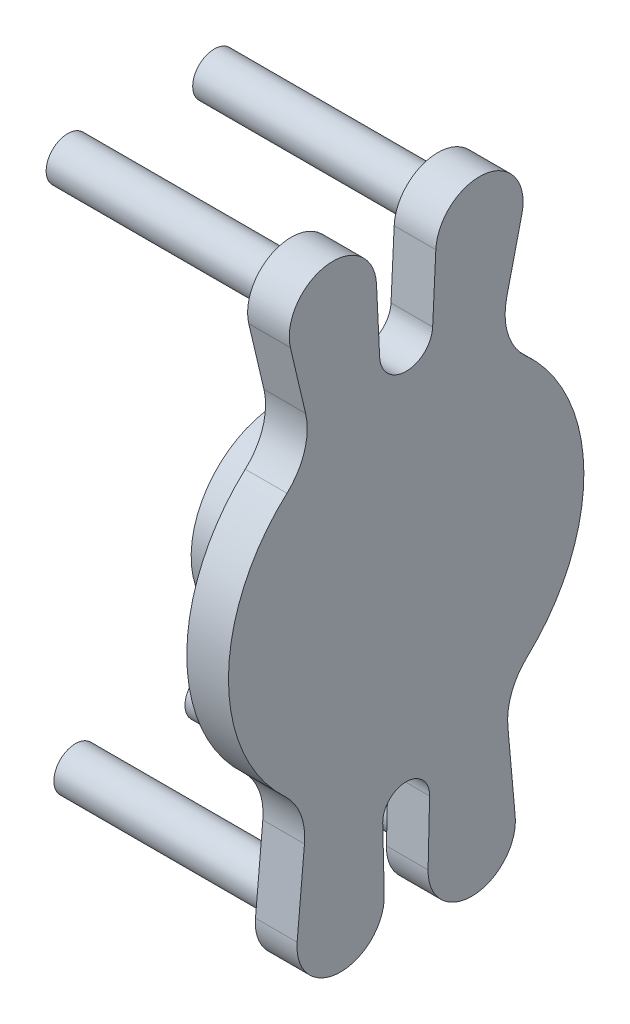
ISO-10303-21;
HEADER;
FILE_DESCRIPTION(('STEP AP214'),'2;1');
FILE_NAME('part.step','',(''),(''),'','','');
FILE_SCHEMA(('AUTOMOTIVE_DESIGN { 1 0 10303 214 1 1 1 1 }'));
ENDSEC;
DATA;
#1=APPLICATION_CONTEXT('core data for automotive mechanical design processes');
#2=APPLICATION_PROTOCOL_DEFINITION('international standard','automotive_design',2000,#1);
#3=PRODUCT_CONTEXT('',#1,'mechanical');
#4=PRODUCT('Part','Part','',(#3));
#5=PRODUCT_RELATED_PRODUCT_CATEGORY('part','',(#4));
#6=PRODUCT_DEFINITION_FORMATION('','',#4);
#7=PRODUCT_DEFINITION_CONTEXT('part definition',#1,'design');
#8=PRODUCT_DEFINITION('design','',#6,#7);
#9=PRODUCT_DEFINITION_SHAPE('','',#8);
#10=(LENGTH_UNIT() NAMED_UNIT(*) SI_UNIT(.MILLI.,.METRE.));
#11=(NAMED_UNIT(*) PLANE_ANGLE_UNIT() SI_UNIT($,.RADIAN.));
#12=(NAMED_UNIT(*) SI_UNIT($,.STERADIAN.) SOLID_ANGLE_UNIT());
#13=UNCERTAINTY_MEASURE_WITH_UNIT(LENGTH_MEASURE(1.E-05),#10,'distance_accuracy_value','');
#14=(GEOMETRIC_REPRESENTATION_CONTEXT(3) GLOBAL_UNCERTAINTY_ASSIGNED_CONTEXT((#13)) GLOBAL_UNIT_ASSIGNED_CONTEXT((#10,
#11,#12)) REPRESENTATION_CONTEXT('',''));
#15=CARTESIAN_POINT('',(0.,0.,0.));
#16=DIRECTION('',(0.,0.,1.));
#17=DIRECTION('',(1.,0.,0.));
#18=AXIS2_PLACEMENT_3D('',#15,#16,#17);
#19=CARTESIAN_POINT('',(8.25500000000001,0.,0.));
#20=DIRECTION('',(1.,0.,0.));
#21=DIRECTION('',(0.,1.,0.));
#22=AXIS2_PLACEMENT_3D('',#19,#20,#21);
#23=PLANE('',#22);
#24=CARTESIAN_POINT('',(8.25500000000001,0.,0.));
#25=DIRECTION('',(-1.,0.,0.));
#26=DIRECTION('',(0.,-1.,0.));
#27=AXIS2_PLACEMENT_3D('',#24,#25,#26);
#28=CIRCLE('',#27,3.71475);
#29=CARTESIAN_POINT('',(8.25500000000001,-3.71474999999999,0.));
#30=VERTEX_POINT('',#29);
#31=EDGE_CURVE('E297',#30,#30,#28,.T.);
#32=ORIENTED_EDGE('',*,*,#31,.F.);
#33=EDGE_LOOP('',(#32));
#34=FACE_BOUND('',#33,.T.);
#35=CARTESIAN_POINT('',(8.25500000000001,0.,0.));
#36=DIRECTION('',(-1.,0.,0.));
#37=DIRECTION('',(0.,-1.,0.));
#38=AXIS2_PLACEMENT_3D('',#35,#36,#37);
#39=CIRCLE('',#38,18.542);
#40=CARTESIAN_POINT('',(8.25500000000002,-18.542,0.));
#41=VERTEX_POINT('',#40);
#42=EDGE_CURVE('E296',#41,#41,#39,.T.);
#43=ORIENTED_EDGE('',*,*,#42,.T.);
#44=EDGE_LOOP('',(#43));
#45=FACE_BOUND('',#44,.T.);
#46=ADVANCED_FACE('F33',(#34,#45),#23,.F.);
#47=CARTESIAN_POINT('',(8.255,0.,0.));
#48=DIRECTION('',(-1.,0.,0.));
#49=DIRECTION('',(0.,-1.,0.));
#50=AXIS2_PLACEMENT_3D('',#47,#48,#49);
#51=CYLINDRICAL_SURFACE('',#50,18.542);
#52=ORIENTED_EDGE('',*,*,#42,.F.);
#53=EDGE_LOOP('',(#52));
#54=FACE_BOUND('',#53,.T.);
#55=CARTESIAN_POINT('',(25.4,0.,0.));
#56=DIRECTION('',(-1.,0.,0.));
#57=DIRECTION('',(0.,-1.,0.));
#58=AXIS2_PLACEMENT_3D('',#55,#56,#57);
#59=CIRCLE('',#58,18.542);
#60=CARTESIAN_POINT('',(25.4,-18.542,0.));
#61=VERTEX_POINT('',#60);
#62=EDGE_CURVE('E292',#61,#61,#59,.T.);
#63=ORIENTED_EDGE('',*,*,#62,.T.);
#64=EDGE_LOOP('',(#63));
#65=FACE_BOUND('',#64,.T.);
#66=ADVANCED_FACE('F342',(#54,#65),#51,.T.);
#67=CARTESIAN_POINT('',(16.8275,0.,0.));
#68=DIRECTION('',(-1.,0.,0.));
#69=DIRECTION('',(0.,-1.,0.));
#70=AXIS2_PLACEMENT_3D('',#67,#68,#69);
#71=CYLINDRICAL_SURFACE('',#70,3.71475);
#72=CARTESIAN_POINT('',(16.8275,0.,0.));
#73=DIRECTION('',(-1.,0.,0.));
#74=DIRECTION('',(0.,-1.,0.));
#75=AXIS2_PLACEMENT_3D('',#72,#73,#74);
#76=CIRCLE('',#75,3.71475);
#77=CARTESIAN_POINT('',(16.8275,-3.71474999999999,0.));
#78=VERTEX_POINT('',#77);
#79=EDGE_CURVE('E293',#78,#78,#76,.T.);
#80=ORIENTED_EDGE('',*,*,#79,.F.);
#81=EDGE_LOOP('',(#80));
#82=FACE_BOUND('',#81,.T.);
#83=ORIENTED_EDGE('',*,*,#31,.T.);
#84=EDGE_LOOP('',(#83));
#85=FACE_BOUND('',#84,.T.);
#86=ADVANCED_FACE('F347',(#82,#85),#71,.F.);
#87=CARTESIAN_POINT('',(16.8275,0.,0.));
#88=DIRECTION('',(-1.,0.,0.));
#89=DIRECTION('',(0.,-1.,0.));
#90=AXIS2_PLACEMENT_3D('',#87,#88,#89);
#91=PLANE('',#90);
#92=ORIENTED_EDGE('',*,*,#79,.T.);
#93=EDGE_LOOP('',(#92));
#94=FACE_BOUND('',#93,.T.);
#95=ADVANCED_FACE('F355',(#94),#91,.T.);
#96=CARTESIAN_POINT('',(33.9725,0.,0.));
#97=DIRECTION('',(-1.,0.,0.));
#98=DIRECTION('',(0.,-1.,0.));
#99=AXIS2_PLACEMENT_3D('',#96,#97,#98);
#100=CYLINDRICAL_SURFACE('',#99,36.576);
#101=CARTESIAN_POINT('',(25.4,0.,0.));
#102=DIRECTION('',(1.,0.,0.));
#103=DIRECTION('',(0.,1.,0.));
#104=AXIS2_PLACEMENT_3D('',#101,#102,#103);
#105=CIRCLE('',#104,36.576);
#106=CARTESIAN_POINT('',(25.4,27.1193867572378,24.5426697388722));
#107=VERTEX_POINT('',#106);
#108=CARTESIAN_POINT('',(25.4,-26.766566092711,24.9269876961605));
#109=VERTEX_POINT('',#108);
#110=EDGE_CURVE('E202',#107,#109,#105,.T.);
#111=ORIENTED_EDGE('',*,*,#110,.T.);
#112=DIRECTION('',(-1.,0.,0.));
#113=VECTOR('',#112,1.);
#114=CARTESIAN_POINT('',(33.9725,-26.766566092711,24.9269876961605));
#115=LINE('',#114,#113);
#116=CARTESIAN_POINT('',(33.9725,-26.766566092711,24.9269876961605));
#117=VERTEX_POINT('',#116);
#118=EDGE_CURVE('E290',#117,#109,#115,.T.);
#119=ORIENTED_EDGE('',*,*,#118,.F.);
#120=CARTESIAN_POINT('',(33.9725,0.,0.));
#121=DIRECTION('',(1.,0.,0.));
#122=DIRECTION('',(0.,1.,0.));
#123=AXIS2_PLACEMENT_3D('',#120,#121,#122);
#124=CIRCLE('',#123,36.576);
#125=CARTESIAN_POINT('',(33.9725,27.1193867572378,24.5426697388722));
#126=VERTEX_POINT('',#125);
#127=EDGE_CURVE('E241',#126,#117,#124,.T.);
#128=ORIENTED_EDGE('',*,*,#127,.F.);
#129=DIRECTION('',(-1.,0.,0.));
#130=VECTOR('',#129,1.);
#131=CARTESIAN_POINT('',(33.9725,27.1193867572378,24.5426697388722));
#132=LINE('',#131,#130);
#133=EDGE_CURVE('E198',#126,#107,#132,.T.);
#134=ORIENTED_EDGE('',*,*,#133,.T.);
#135=EDGE_LOOP('',(#111,#119,#128,#134));
#136=FACE_BOUND('',#135,.T.);
#137=ADVANCED_FACE('F330',(#136),#100,.T.);
#138=CARTESIAN_POINT('',(33.9725,-36.06051265268,33.5821917573273));
#139=DIRECTION('',(-1.,0.,0.));
#140=DIRECTION('',(0.,-1.,0.));
#141=AXIS2_PLACEMENT_3D('',#138,#139,#140);
#142=CYLINDRICAL_SURFACE('',#141,12.7);
#143=CARTESIAN_POINT('',(25.4,-36.06051265268,33.5821917573273));
#144=DIRECTION('',(-1.,0.,0.));
#145=DIRECTION('',(0.,-1.,0.));
#146=AXIS2_PLACEMENT_3D('',#143,#144,#145);
#147=CIRCLE('',#146,12.7);
#148=CARTESIAN_POINT('',(25.4,-37.199446596565,20.9333645598569));
#149=VERTEX_POINT('',#148);
#150=EDGE_CURVE('E205',#109,#149,#147,.T.);
#151=ORIENTED_EDGE('',*,*,#150,.T.);
#152=DIRECTION('',(-1.,0.,0.));
#153=VECTOR('',#152,1.);
#154=CARTESIAN_POINT('',(33.9725,-37.199446596565,20.9333645598569));
#155=LINE('',#154,#153);
#156=CARTESIAN_POINT('',(33.9725,-37.199446596565,20.9333645598569));
#157=VERTEX_POINT('',#156);
#158=EDGE_CURVE('E287',#157,#149,#155,.T.);
#159=ORIENTED_EDGE('',*,*,#158,.F.);
#160=CARTESIAN_POINT('',(33.9725,-36.06051265268,33.5821917573273));
#161=DIRECTION('',(-1.,0.,0.));
#162=DIRECTION('',(0.,-1.,0.));
#163=AXIS2_PLACEMENT_3D('',#160,#161,#162);
#164=CIRCLE('',#163,12.7);
#165=EDGE_CURVE('E129',#117,#157,#164,.T.);
#166=ORIENTED_EDGE('',*,*,#165,.F.);
#167=ORIENTED_EDGE('',*,*,#118,.T.);
#168=EDGE_LOOP('',(#151,#159,#166,#167));
#169=FACE_BOUND('',#168,.T.);
#170=ADVANCED_FACE('F367',(#169),#142,.F.);
#171=CARTESIAN_POINT('',(33.9725,-37.199446596565,20.9333645598569));
#172=DIRECTION('',(0.,-0.0896798381011747,-0.99597064547011));
#173=DIRECTION('',(0.,0.99597064547011,-0.0896798381011748));
#174=AXIS2_PLACEMENT_3D('',#171,#172,#173);
#175=PLANE('',#174);
#176=DIRECTION('',(0.,-0.99597064547011,0.0896798381011748));
#177=VECTOR('',#176,1.);
#178=CARTESIAN_POINT('',(25.4,-37.199446596565,20.9333645598569));
#179=LINE('',#178,#177);
#180=CARTESIAN_POINT('',(25.4,-53.9629542347014,22.4427952422103));
#181=VERTEX_POINT('',#180);
#182=EDGE_CURVE('E208',#149,#181,#179,.T.);
#183=ORIENTED_EDGE('',*,*,#182,.T.);
#184=DIRECTION('',(-1.,0.,0.));
#185=VECTOR('',#184,1.);
#186=CARTESIAN_POINT('',(33.9725,-53.9629542347014,22.4427952422103));
#187=LINE('',#186,#185);
#188=CARTESIAN_POINT('',(33.9725,-53.9629542347014,22.4427952422103));
#189=VERTEX_POINT('',#188);
#190=EDGE_CURVE('E284',#189,#181,#187,.T.);
#191=ORIENTED_EDGE('',*,*,#190,.F.);
#192=DIRECTION('',(0.,-0.99597064547011,0.0896798381011748));
#193=VECTOR('',#192,1.);
#194=CARTESIAN_POINT('',(33.9725,-37.199446596565,20.9333645598569));
#195=LINE('',#194,#193);
#196=EDGE_CURVE('E552',#157,#189,#195,.T.);
#197=ORIENTED_EDGE('',*,*,#196,.F.);
#198=ORIENTED_EDGE('',*,*,#158,.T.);
#199=EDGE_LOOP('',(#183,#191,#197,#198));
#200=FACE_BOUND('',#199,.T.);
#201=ADVANCED_FACE('F370',(#200),#175,.F.);
#202=CARTESIAN_POINT('',(33.9725,-54.76875,13.49375));
#203=DIRECTION('',(-1.,0.,0.));
#204=DIRECTION('',(0.,-1.,0.));
#205=AXIS2_PLACEMENT_3D('',#202,#203,#204);
#206=CYLINDRICAL_SURFACE('',#205,8.98524999999999);
#207=CARTESIAN_POINT('',(25.4,-54.76875,13.49375));
#208=DIRECTION('',(1.,0.,0.));
#209=DIRECTION('',(0.,1.,0.));
#210=AXIS2_PLACEMENT_3D('',#207,#208,#209);
#211=CIRCLE('',#210,8.98524999999999);
#212=CARTESIAN_POINT('',(25.4,-54.5527011469293,4.51109780504184));
#213=VERTEX_POINT('',#212);
#214=EDGE_CURVE('E210',#181,#213,#211,.T.);
#215=ORIENTED_EDGE('',*,*,#214,.T.);
#216=DIRECTION('',(-1.,0.,0.));
#217=VECTOR('',#216,1.);
#218=CARTESIAN_POINT('',(33.9725,-54.5527011469293,4.51109780504184));
#219=LINE('',#218,#217);
#220=CARTESIAN_POINT('',(33.9725,-54.5527011469293,4.51109780504184));
#221=VERTEX_POINT('',#220);
#222=EDGE_CURVE('E281',#221,#213,#219,.T.);
#223=ORIENTED_EDGE('',*,*,#222,.F.);
#224=CARTESIAN_POINT('',(33.9725,-54.76875,13.49375));
#225=DIRECTION('',(1.,0.,0.));
#226=DIRECTION('',(0.,1.,0.));
#227=AXIS2_PLACEMENT_3D('',#224,#225,#226);
#228=CIRCLE('',#227,8.98524999999999);
#229=EDGE_CURVE('E554',#189,#221,#228,.T.);
#230=ORIENTED_EDGE('',*,*,#229,.F.);
#231=ORIENTED_EDGE('',*,*,#190,.T.);
#232=EDGE_LOOP('',(#215,#223,#230,#231));
#233=FACE_BOUND('',#232,.T.);
#234=ADVANCED_FACE('F373',(#233),#206,.T.);
#235=CARTESIAN_POINT('',(33.9725,-54.5527011469293,4.51109780504184));
#236=DIRECTION('',(0.,-0.0240448349317749,0.999710881161701));
#237=DIRECTION('',(0.,-0.999710881161701,-0.0240448349317749));
#238=AXIS2_PLACEMENT_3D('',#235,#236,#237);
#239=PLANE('',#238);
#240=DIRECTION('',(0.,0.999710881161701,0.0240448349317749));
#241=VECTOR('',#240,1.);
#242=CARTESIAN_POINT('',(25.4,-54.5527011469293,4.51109780504184));
#243=LINE('',#242,#241);
#244=CARTESIAN_POINT('',(25.4,-41.5180403733808,4.82460471248639));
#245=VERTEX_POINT('',#244);
#246=EDGE_CURVE('E212',#213,#245,#243,.T.);
#247=ORIENTED_EDGE('',*,*,#246,.T.);
#248=DIRECTION('',(-1.,0.,0.));
#249=VECTOR('',#248,1.);
#250=CARTESIAN_POINT('',(33.9725,-41.5180403733807,4.82460471248639));
#251=LINE('',#250,#249);
#252=CARTESIAN_POINT('',(33.9725,-41.5180403733807,4.82460471248639));
#253=VERTEX_POINT('',#252);
#254=EDGE_CURVE('E278',#253,#245,#251,.T.);
#255=ORIENTED_EDGE('',*,*,#254,.F.);
#256=DIRECTION('',(0.,0.999710881161701,0.0240448349317749));
#257=VECTOR('',#256,1.);
#258=CARTESIAN_POINT('',(33.9725,-54.5527011469293,4.51109780504184));
#259=LINE('',#258,#257);
#260=EDGE_CURVE('E556',#221,#253,#259,.T.);
#261=ORIENTED_EDGE('',*,*,#260,.F.);
#262=ORIENTED_EDGE('',*,*,#222,.T.);
#263=EDGE_LOOP('',(#247,#255,#261,#262));
#264=FACE_BOUND('',#263,.T.);
#265=ADVANCED_FACE('F377',(#264),#239,.F.);
#266=CARTESIAN_POINT('',(33.9725,-41.402,0.));
#267=DIRECTION('',(-1.,0.,0.));
#268=DIRECTION('',(0.,-1.,0.));
#269=AXIS2_PLACEMENT_3D('',#266,#267,#268);
#270=CYLINDRICAL_SURFACE('',#269,4.82600000000001);
#271=CARTESIAN_POINT('',(25.4,-41.402,0.));
#272=DIRECTION('',(-1.,0.,0.));
#273=DIRECTION('',(0.,-1.,0.));
#274=AXIS2_PLACEMENT_3D('',#271,#272,#273);
#275=CIRCLE('',#274,4.82600000000001);
#276=CARTESIAN_POINT('',(25.4,-41.5180403733808,-4.82460471248639));
#277=VERTEX_POINT('',#276);
#278=EDGE_CURVE('E214',#245,#277,#275,.T.);
#279=ORIENTED_EDGE('',*,*,#278,.T.);
#280=DIRECTION('',(-1.,0.,0.));
#281=VECTOR('',#280,1.);
#282=CARTESIAN_POINT('',(33.9725,-41.5180403733807,-4.82460471248639));
#283=LINE('',#282,#281);
#284=CARTESIAN_POINT('',(33.9725,-41.5180403733807,-4.82460471248639));
#285=VERTEX_POINT('',#284);
#286=EDGE_CURVE('E275',#285,#277,#283,.T.);
#287=ORIENTED_EDGE('',*,*,#286,.F.);
#288=CARTESIAN_POINT('',(33.9725,-41.402,0.));
#289=DIRECTION('',(-1.,0.,0.));
#290=DIRECTION('',(0.,-1.,0.));
#291=AXIS2_PLACEMENT_3D('',#288,#289,#290);
#292=CIRCLE('',#291,4.82600000000001);
#293=EDGE_CURVE('E558',#253,#285,#292,.T.);
#294=ORIENTED_EDGE('',*,*,#293,.F.);
#295=ORIENTED_EDGE('',*,*,#254,.T.);
#296=EDGE_LOOP('',(#279,#287,#294,#295));
#297=FACE_BOUND('',#296,.T.);
#298=ADVANCED_FACE('F381',(#297),#270,.F.);
#299=CARTESIAN_POINT('',(33.9725,-54.5527011469293,-4.51109780504187));
#300=DIRECTION('',(0.,-0.0240448349317741,-0.999710881161701));
#301=DIRECTION('',(0.,0.999710881161701,-0.0240448349317741));
#302=AXIS2_PLACEMENT_3D('',#299,#300,#301);
#303=PLANE('',#302);
#304=DIRECTION('',(0.,-0.999710881161701,0.0240448349317741));
#305=VECTOR('',#304,1.);
#306=CARTESIAN_POINT('',(25.4,-54.5527011469293,-4.51109780504187));
#307=LINE('',#306,#305);
#308=CARTESIAN_POINT('',(25.4,-54.5527011469293,-4.51109780504184));
#309=VERTEX_POINT('',#308);
#310=EDGE_CURVE('E216',#277,#309,#307,.T.);
#311=ORIENTED_EDGE('',*,*,#310,.T.);
#312=DIRECTION('',(-1.,0.,0.));
#313=VECTOR('',#312,1.);
#314=CARTESIAN_POINT('',(33.9725,-54.5527011469293,-4.51109780504184));
#315=LINE('',#314,#313);
#316=CARTESIAN_POINT('',(33.9725,-54.5527011469293,-4.51109780504184));
#317=VERTEX_POINT('',#316);
#318=EDGE_CURVE('E272',#317,#309,#315,.T.);
#319=ORIENTED_EDGE('',*,*,#318,.F.);
#320=DIRECTION('',(0.,-0.999710881161701,0.0240448349317741));
#321=VECTOR('',#320,1.);
#322=CARTESIAN_POINT('',(33.9725,-54.5527011469293,-4.51109780504187));
#323=LINE('',#322,#321);
#324=EDGE_CURVE('E560',#285,#317,#323,.T.);
#325=ORIENTED_EDGE('',*,*,#324,.F.);
#326=ORIENTED_EDGE('',*,*,#286,.T.);
#327=EDGE_LOOP('',(#311,#319,#325,#326));
#328=FACE_BOUND('',#327,.T.);
#329=ADVANCED_FACE('F385',(#328),#303,.F.);
#330=CARTESIAN_POINT('',(33.9725,-54.76875,-13.49375));
#331=DIRECTION('',(-1.,0.,0.));
#332=DIRECTION('',(0.,-1.,0.));
#333=AXIS2_PLACEMENT_3D('',#330,#331,#332);
#334=CYLINDRICAL_SURFACE('',#333,8.98524999999999);
#335=CARTESIAN_POINT('',(25.4,-54.76875,-13.49375));
#336=DIRECTION('',(1.,0.,0.));
#337=DIRECTION('',(0.,1.,0.));
#338=AXIS2_PLACEMENT_3D('',#335,#336,#337);
#339=CIRCLE('',#338,8.98524999999999);
#340=CARTESIAN_POINT('',(25.4,-53.9629542347014,-22.4427952422103));
#341=VERTEX_POINT('',#340);
#342=EDGE_CURVE('E218',#309,#341,#339,.T.);
#343=ORIENTED_EDGE('',*,*,#342,.T.);
#344=DIRECTION('',(-1.,0.,0.));
#345=VECTOR('',#344,1.);
#346=CARTESIAN_POINT('',(33.9725,-53.9629542347014,-22.4427952422103));
#347=LINE('',#346,#345);
#348=CARTESIAN_POINT('',(33.9725,-53.9629542347014,-22.4427952422103));
#349=VERTEX_POINT('',#348);
#350=EDGE_CURVE('E269',#349,#341,#347,.T.);
#351=ORIENTED_EDGE('',*,*,#350,.F.);
#352=CARTESIAN_POINT('',(33.9725,-54.76875,-13.49375));
#353=DIRECTION('',(1.,0.,0.));
#354=DIRECTION('',(0.,1.,0.));
#355=AXIS2_PLACEMENT_3D('',#352,#353,#354);
#356=CIRCLE('',#355,8.98524999999999);
#357=EDGE_CURVE('E562',#317,#349,#356,.T.);
#358=ORIENTED_EDGE('',*,*,#357,.F.);
#359=ORIENTED_EDGE('',*,*,#318,.T.);
#360=EDGE_LOOP('',(#343,#351,#358,#359));
#361=FACE_BOUND('',#360,.T.);
#362=ADVANCED_FACE('F389',(#361),#334,.T.);
#363=CARTESIAN_POINT('',(33.9725,-37.1994465965649,-20.9333645598569));
#364=DIRECTION('',(0.,-0.0896798381011756,0.99597064547011));
#365=DIRECTION('',(0.,-0.99597064547011,-0.0896798381011756));
#366=AXIS2_PLACEMENT_3D('',#363,#364,#365);
#367=PLANE('',#366);
#368=DIRECTION('',(0.,0.99597064547011,0.0896798381011756));
#369=VECTOR('',#368,1.);
#370=CARTESIAN_POINT('',(25.4,-37.1994465965649,-20.9333645598569));
#371=LINE('',#370,#369);
#372=CARTESIAN_POINT('',(25.4,-37.1994465965649,-20.9333645598569));
#373=VERTEX_POINT('',#372);
#374=EDGE_CURVE('E220',#341,#373,#371,.T.);
#375=ORIENTED_EDGE('',*,*,#374,.T.);
#376=DIRECTION('',(-1.,0.,0.));
#377=VECTOR('',#376,1.);
#378=CARTESIAN_POINT('',(33.9725,-37.1994465965649,-20.9333645598569));
#379=LINE('',#378,#377);
#380=CARTESIAN_POINT('',(33.9725,-37.1994465965649,-20.9333645598569));
#381=VERTEX_POINT('',#380);
#382=EDGE_CURVE('E266',#381,#373,#379,.T.);
#383=ORIENTED_EDGE('',*,*,#382,.F.);
#384=DIRECTION('',(0.,0.99597064547011,0.0896798381011756));
#385=VECTOR('',#384,1.);
#386=CARTESIAN_POINT('',(33.9725,-37.1994465965649,-20.9333645598569));
#387=LINE('',#386,#385);
#388=EDGE_CURVE('E564',#349,#381,#387,.T.);
#389=ORIENTED_EDGE('',*,*,#388,.F.);
#390=ORIENTED_EDGE('',*,*,#350,.T.);
#391=EDGE_LOOP('',(#375,#383,#389,#390));
#392=FACE_BOUND('',#391,.T.);
#393=ADVANCED_FACE('F393',(#392),#367,.F.);
#394=CARTESIAN_POINT('',(33.9725,-36.06051265268,-33.5821917573273));
#395=DIRECTION('',(-1.,0.,0.));
#396=DIRECTION('',(0.,-1.,0.));
#397=AXIS2_PLACEMENT_3D('',#394,#395,#396);
#398=CYLINDRICAL_SURFACE('',#397,12.7);
#399=CARTESIAN_POINT('',(25.4,-36.06051265268,-33.5821917573273));
#400=DIRECTION('',(-1.,0.,0.));
#401=DIRECTION('',(0.,1.,0.));
#402=AXIS2_PLACEMENT_3D('',#399,#400,#401);
#403=CIRCLE('',#402,12.7);
#404=CARTESIAN_POINT('',(25.4,-26.766566092711,-24.9269876961605));
#405=VERTEX_POINT('',#404);
#406=EDGE_CURVE('E222',#373,#405,#403,.T.);
#407=ORIENTED_EDGE('',*,*,#406,.T.);
#408=DIRECTION('',(-1.,0.,0.));
#409=VECTOR('',#408,1.);
#410=CARTESIAN_POINT('',(33.9725,-26.7665660927109,-24.9269876961605));
#411=LINE('',#410,#409);
#412=CARTESIAN_POINT('',(33.9725,-26.7665660927109,-24.9269876961605));
#413=VERTEX_POINT('',#412);
#414=EDGE_CURVE('E263',#413,#405,#411,.T.);
#415=ORIENTED_EDGE('',*,*,#414,.F.);
#416=CARTESIAN_POINT('',(33.9725,-36.06051265268,-33.5821917573273));
#417=DIRECTION('',(-1.,0.,0.));
#418=DIRECTION('',(0.,1.,0.));
#419=AXIS2_PLACEMENT_3D('',#416,#417,#418);
#420=CIRCLE('',#419,12.7);
#421=EDGE_CURVE('E566',#381,#413,#420,.T.);
#422=ORIENTED_EDGE('',*,*,#421,.F.);
#423=ORIENTED_EDGE('',*,*,#382,.T.);
#424=EDGE_LOOP('',(#407,#415,#422,#423));
#425=FACE_BOUND('',#424,.T.);
#426=ADVANCED_FACE('F397',(#425),#398,.F.);
#427=CARTESIAN_POINT('',(33.9725,0.,0.));
#428=DIRECTION('',(-1.,0.,0.));
#429=DIRECTION('',(0.,-1.,0.));
#430=AXIS2_PLACEMENT_3D('',#427,#428,#429);
#431=CYLINDRICAL_SURFACE('',#430,36.576);
#432=CARTESIAN_POINT('',(25.4,0.,0.));
#433=DIRECTION('',(1.,0.,0.));
#434=DIRECTION('',(0.,1.,0.));
#435=AXIS2_PLACEMENT_3D('',#432,#433,#434);
#436=CIRCLE('',#435,36.576);
#437=CARTESIAN_POINT('',(25.4,27.1193867572378,-24.5426697388722));
#438=VERTEX_POINT('',#437);
#439=EDGE_CURVE('E224',#405,#438,#436,.T.);
#440=ORIENTED_EDGE('',*,*,#439,.T.);
#441=DIRECTION('',(-1.,0.,0.));
#442=VECTOR('',#441,1.);
#443=CARTESIAN_POINT('',(33.9725,27.1193867572378,-24.5426697388722));
#444=LINE('',#443,#442);
#445=CARTESIAN_POINT('',(33.9725,27.1193867572378,-24.5426697388722));
#446=VERTEX_POINT('',#445);
#447=EDGE_CURVE('E260',#446,#438,#444,.T.);
#448=ORIENTED_EDGE('',*,*,#447,.F.);
#449=CARTESIAN_POINT('',(33.9725,0.,0.));
#450=DIRECTION('',(1.,0.,0.));
#451=DIRECTION('',(0.,1.,0.));
#452=AXIS2_PLACEMENT_3D('',#449,#450,#451);
#453=CIRCLE('',#452,36.576);
#454=EDGE_CURVE('E568',#413,#446,#453,.T.);
#455=ORIENTED_EDGE('',*,*,#454,.F.);
#456=ORIENTED_EDGE('',*,*,#414,.T.);
#457=EDGE_LOOP('',(#440,#448,#455,#456));
#458=FACE_BOUND('',#457,.T.);
#459=ADVANCED_FACE('F401',(#458),#431,.T.);
#460=CARTESIAN_POINT('',(33.9725,36.5358404923898,-33.0644300648696));
#461=DIRECTION('',(-1.,0.,0.));
#462=DIRECTION('',(0.,-1.,0.));
#463=AXIS2_PLACEMENT_3D('',#460,#461,#462);
#464=CYLINDRICAL_SURFACE('',#463,12.7);
#465=CARTESIAN_POINT('',(25.4,36.5358404923898,-33.0644300648696));
#466=DIRECTION('',(-1.,0.,0.));
#467=DIRECTION('',(0.,-1.,0.));
#468=AXIS2_PLACEMENT_3D('',#465,#466,#467);
#469=CIRCLE('',#468,12.7);
#470=CARTESIAN_POINT('',(25.4,39.4483236675717,-20.7028993443527));
#471=VERTEX_POINT('',#470);
#472=EDGE_CURVE('E226',#438,#471,#469,.T.);
#473=ORIENTED_EDGE('',*,*,#472,.T.);
#474=DIRECTION('',(-1.,0.,0.));
#475=VECTOR('',#474,1.);
#476=CARTESIAN_POINT('',(33.9725,39.4483236675717,-20.7028993443527));
#477=LINE('',#476,#475);
#478=CARTESIAN_POINT('',(33.9725,39.4483236675717,-20.7028993443527));
#479=VERTEX_POINT('',#478);
#480=EDGE_CURVE('E257',#479,#471,#477,.T.);
#481=ORIENTED_EDGE('',*,*,#480,.F.);
#482=CARTESIAN_POINT('',(33.9725,36.5358404923898,-33.0644300648696));
#483=DIRECTION('',(-1.,0.,0.));
#484=DIRECTION('',(0.,-1.,0.));
#485=AXIS2_PLACEMENT_3D('',#482,#483,#484);
#486=CIRCLE('',#485,12.7);
#487=EDGE_CURVE('E570',#446,#479,#486,.T.);
#488=ORIENTED_EDGE('',*,*,#487,.F.);
#489=ORIENTED_EDGE('',*,*,#447,.T.);
#490=EDGE_LOOP('',(#473,#481,#488,#489));
#491=FACE_BOUND('',#490,.T.);
#492=ADVANCED_FACE('F405',(#491),#464,.F.);
#493=CARTESIAN_POINT('',(33.9725,39.4483236675717,-20.7028993443527));
#494=DIRECTION('',(0.,0.229329383872591,0.97334887563125));
#495=DIRECTION('',(0.,-0.97334887563125,0.229329383872591));
#496=AXIS2_PLACEMENT_3D('',#493,#494,#495);
#497=PLANE('',#496);
#498=DIRECTION('',(0.,0.97334887563125,-0.229329383872591));
#499=VECTOR('',#498,1.);
#500=CARTESIAN_POINT('',(25.4,39.4483236675717,-20.7028993443527));
#501=LINE('',#500,#499);
#502=CARTESIAN_POINT('',(25.4,52.7081681535588,-23.8270329847657));
#503=VERTEX_POINT('',#502);
#504=EDGE_CURVE('E228',#471,#503,#501,.T.);
#505=ORIENTED_EDGE('',*,*,#504,.T.);
#506=DIRECTION('',(-1.,0.,0.));
#507=VECTOR('',#506,1.);
#508=CARTESIAN_POINT('',(33.9725,52.7081681535588,-23.8270329847657));
#509=LINE('',#508,#507);
#510=CARTESIAN_POINT('',(33.9725,52.7081681535588,-23.8270329847657));
#511=VERTEX_POINT('',#510);
#512=EDGE_CURVE('E254',#511,#503,#509,.T.);
#513=ORIENTED_EDGE('',*,*,#512,.F.);
#514=DIRECTION('',(0.,0.97334887563125,-0.229329383872591));
#515=VECTOR('',#514,1.);
#516=CARTESIAN_POINT('',(33.9725,39.4483236675717,-20.7028993443527));
#517=LINE('',#516,#515);
#518=EDGE_CURVE('E572',#479,#511,#517,.T.);
#519=ORIENTED_EDGE('',*,*,#518,.F.);
#520=ORIENTED_EDGE('',*,*,#480,.T.);
#521=EDGE_LOOP('',(#505,#513,#519,#520));
#522=FACE_BOUND('',#521,.T.);
#523=ADVANCED_FACE('F409',(#522),#497,.F.);
#524=CARTESIAN_POINT('',(33.9725,54.76875,-15.08125));
#525=DIRECTION('',(-1.,0.,0.));
#526=DIRECTION('',(0.,-1.,0.));
#527=AXIS2_PLACEMENT_3D('',#524,#525,#526);
#528=CYLINDRICAL_SURFACE('',#527,8.98525);
#529=CARTESIAN_POINT('',(25.4,54.76875,-15.08125));
#530=DIRECTION('',(1.,0.,0.));
#531=DIRECTION('',(0.,1.,0.));
#532=AXIS2_PLACEMENT_3D('',#529,#530,#531);
#533=CIRCLE('',#532,8.98525);
#534=CARTESIAN_POINT('',(25.4,55.2051921211717,-6.10660594926648));
#535=VERTEX_POINT('',#534);
#536=EDGE_CURVE('E230',#503,#535,#533,.T.);
#537=ORIENTED_EDGE('',*,*,#536,.T.);
#538=DIRECTION('',(-1.,0.,0.));
#539=VECTOR('',#538,1.);
#540=CARTESIAN_POINT('',(33.9725,55.2051921211717,-6.10660594926648));
#541=LINE('',#540,#539);
#542=CARTESIAN_POINT('',(33.9725,55.2051921211717,-6.10660594926648));
#543=VERTEX_POINT('',#542);
#544=EDGE_CURVE('E251',#543,#535,#541,.T.);
#545=ORIENTED_EDGE('',*,*,#544,.F.);
#546=CARTESIAN_POINT('',(33.9725,54.76875,-15.08125));
#547=DIRECTION('',(1.,0.,0.));
#548=DIRECTION('',(0.,1.,0.));
#549=AXIS2_PLACEMENT_3D('',#546,#547,#548);
#550=CIRCLE('',#549,8.98525);
#551=EDGE_CURVE('E574',#511,#543,#550,.T.);
#552=ORIENTED_EDGE('',*,*,#551,.F.);
#553=ORIENTED_EDGE('',*,*,#512,.T.);
#554=EDGE_LOOP('',(#537,#545,#552,#553));
#555=FACE_BOUND('',#554,.T.);
#556=ADVANCED_FACE('F413',(#555),#528,.T.);
#557=CARTESIAN_POINT('',(33.9725,55.2051921211717,-6.10660594926648));
#558=DIRECTION('',(0.,-0.0485731750559753,-0.998819626691918));
#559=DIRECTION('',(0.,0.998819626691918,-0.0485731750559753));
#560=AXIS2_PLACEMENT_3D('',#557,#558,#559);
#561=PLANE('',#560);
#562=DIRECTION('',(0.,-0.998819626691917,0.0485731750559753));
#563=VECTOR('',#562,1.);
#564=CARTESIAN_POINT('',(25.4,55.2051921211717,-6.10660594926648));
#565=LINE('',#564,#563);
#566=CARTESIAN_POINT('',(25.4,41.7705188645479,-5.45327003307596));
#567=VERTEX_POINT('',#566);
#568=EDGE_CURVE('E232',#535,#567,#565,.T.);
#569=ORIENTED_EDGE('',*,*,#568,.T.);
#570=DIRECTION('',(-1.,0.,0.));
#571=VECTOR('',#570,1.);
#572=CARTESIAN_POINT('',(33.9725,41.7705188645479,-5.45327003307596));
#573=LINE('',#572,#571);
#574=CARTESIAN_POINT('',(33.9725,41.7705188645479,-5.45327003307596));
#575=VERTEX_POINT('',#574);
#576=EDGE_CURVE('E248',#575,#567,#573,.T.);
#577=ORIENTED_EDGE('',*,*,#576,.F.);
#578=DIRECTION('',(0.,-0.998819626691917,0.0485731750559753));
#579=VECTOR('',#578,1.);
#580=CARTESIAN_POINT('',(33.9725,55.2051921211717,-6.10660594926648));
#581=LINE('',#580,#579);
#582=EDGE_CURVE('E576',#543,#575,#581,.T.);
#583=ORIENTED_EDGE('',*,*,#582,.F.);
#584=ORIENTED_EDGE('',*,*,#544,.T.);
#585=EDGE_LOOP('',(#569,#577,#583,#584));
#586=FACE_BOUND('',#585,.T.);
#587=ADVANCED_FACE('F417',(#586),#561,.F.);
#588=CARTESIAN_POINT('',(33.9725,42.0357145343821,0.));
#589=DIRECTION('',(-1.,0.,0.));
#590=DIRECTION('',(0.,-1.,0.));
#591=AXIS2_PLACEMENT_3D('',#588,#589,#590);
#592=CYLINDRICAL_SURFACE('',#591,5.4597145343821);
#593=CARTESIAN_POINT('',(25.4,42.0357145343821,0.));
#594=DIRECTION('',(-1.,0.,0.));
#595=DIRECTION('',(0.,1.,0.));
#596=AXIS2_PLACEMENT_3D('',#593,#594,#595);
#597=CIRCLE('',#596,5.4597145343821);
#598=CARTESIAN_POINT('',(25.4,41.7705188645479,5.45327003307596));
#599=VERTEX_POINT('',#598);
#600=EDGE_CURVE('E234',#567,#599,#597,.T.);
#601=ORIENTED_EDGE('',*,*,#600,.T.);
#602=DIRECTION('',(-1.,0.,0.));
#603=VECTOR('',#602,1.);
#604=CARTESIAN_POINT('',(33.9725,41.7705188645479,5.45327003307596));
#605=LINE('',#604,#603);
#606=CARTESIAN_POINT('',(33.9725,41.7705188645479,5.45327003307596));
#607=VERTEX_POINT('',#606);
#608=EDGE_CURVE('E245',#607,#599,#605,.T.);
#609=ORIENTED_EDGE('',*,*,#608,.F.);
#610=CARTESIAN_POINT('',(33.9725,42.0357145343821,0.));
#611=DIRECTION('',(-1.,0.,0.));
#612=DIRECTION('',(0.,1.,0.));
#613=AXIS2_PLACEMENT_3D('',#610,#611,#612);
#614=CIRCLE('',#613,5.4597145343821);
#615=EDGE_CURVE('E578',#575,#607,#614,.T.);
#616=ORIENTED_EDGE('',*,*,#615,.F.);
#617=ORIENTED_EDGE('',*,*,#576,.T.);
#618=EDGE_LOOP('',(#601,#609,#616,#617));
#619=FACE_BOUND('',#618,.T.);
#620=ADVANCED_FACE('F421',(#619),#592,.F.);
#621=CARTESIAN_POINT('',(33.9725,55.2051921211717,6.10660594926645));
#622=DIRECTION('',(0.,-0.0485731750559745,0.998819626691918));
#623=DIRECTION('',(0.,-0.998819626691918,-0.0485731750559745));
#624=AXIS2_PLACEMENT_3D('',#621,#622,#623);
#625=PLANE('',#624);
#626=DIRECTION('',(0.,0.998819626691918,0.0485731750559745));
#627=VECTOR('',#626,1.);
#628=CARTESIAN_POINT('',(25.4,55.2051921211717,6.10660594926645));
#629=LINE('',#628,#627);
#630=CARTESIAN_POINT('',(25.4,55.2051921211717,6.10660594926644));
#631=VERTEX_POINT('',#630);
#632=EDGE_CURVE('E236',#599,#631,#629,.T.);
#633=ORIENTED_EDGE('',*,*,#632,.T.);
#634=DIRECTION('',(-1.,0.,0.));
#635=VECTOR('',#634,1.);
#636=CARTESIAN_POINT('',(33.9725,55.2051921211717,6.10660594926644));
#637=LINE('',#636,#635);
#638=CARTESIAN_POINT('',(33.9725,55.2051921211717,6.10660594926644));
#639=VERTEX_POINT('',#638);
#640=EDGE_CURVE('E193',#639,#631,#637,.T.);
#641=ORIENTED_EDGE('',*,*,#640,.F.);
#642=DIRECTION('',(0.,0.998819626691918,0.0485731750559745));
#643=VECTOR('',#642,1.);
#644=CARTESIAN_POINT('',(33.9725,55.2051921211717,6.10660594926645));
#645=LINE('',#644,#643);
#646=EDGE_CURVE('E184',#607,#639,#645,.T.);
#647=ORIENTED_EDGE('',*,*,#646,.F.);
#648=ORIENTED_EDGE('',*,*,#608,.T.);
#649=EDGE_LOOP('',(#633,#641,#647,#648));
#650=FACE_BOUND('',#649,.T.);
#651=ADVANCED_FACE('F425',(#650),#625,.F.);
#652=CARTESIAN_POINT('',(33.9725,54.76875,15.08125));
#653=DIRECTION('',(-1.,0.,0.));
#654=DIRECTION('',(0.,-1.,0.));
#655=AXIS2_PLACEMENT_3D('',#652,#653,#654);
#656=CYLINDRICAL_SURFACE('',#655,8.98525);
#657=CARTESIAN_POINT('',(25.4,54.76875,15.08125));
#658=DIRECTION('',(1.,0.,0.));
#659=DIRECTION('',(0.,1.,0.));
#660=AXIS2_PLACEMENT_3D('',#657,#658,#659);
#661=CIRCLE('',#660,8.98525);
#662=CARTESIAN_POINT('',(25.4,52.7081681535588,23.8270329847657));
#663=VERTEX_POINT('',#662);
#664=EDGE_CURVE('E192',#631,#663,#661,.T.);
#665=ORIENTED_EDGE('',*,*,#664,.T.);
#666=DIRECTION('',(-1.,0.,0.));
#667=VECTOR('',#666,1.);
#668=CARTESIAN_POINT('',(33.9725,52.7081681535588,23.8270329847657));
#669=LINE('',#668,#667);
#670=CARTESIAN_POINT('',(33.9725,52.7081681535588,23.8270329847657));
#671=VERTEX_POINT('',#670);
#672=EDGE_CURVE('E189',#671,#663,#669,.T.);
#673=ORIENTED_EDGE('',*,*,#672,.F.);
#674=CARTESIAN_POINT('',(33.9725,54.76875,15.08125));
#675=DIRECTION('',(1.,0.,0.));
#676=DIRECTION('',(0.,1.,0.));
#677=AXIS2_PLACEMENT_3D('',#674,#675,#676);
#678=CIRCLE('',#677,8.98525);
#679=EDGE_CURVE('E178',#639,#671,#678,.T.);
#680=ORIENTED_EDGE('',*,*,#679,.F.);
#681=ORIENTED_EDGE('',*,*,#640,.T.);
#682=EDGE_LOOP('',(#665,#673,#680,#681));
#683=FACE_BOUND('',#682,.T.);
#684=ADVANCED_FACE('F190',(#683),#656,.T.);
#685=CARTESIAN_POINT('',(33.9725,39.4483236675717,20.7028993443527));
#686=DIRECTION('',(0.,0.22932938387259,-0.97334887563125));
#687=DIRECTION('',(0.,0.97334887563125,0.22932938387259));
#688=AXIS2_PLACEMENT_3D('',#685,#686,#687);
#689=PLANE('',#688);
#690=DIRECTION('',(0.,-0.97334887563125,-0.22932938387259));
#691=VECTOR('',#690,1.);
#692=CARTESIAN_POINT('',(25.4,39.4483236675717,20.7028993443527));
#693=LINE('',#692,#691);
#694=CARTESIAN_POINT('',(25.4,39.4483236675717,20.7028993443527));
#695=VERTEX_POINT('',#694);
#696=EDGE_CURVE('E114',#663,#695,#693,.T.);
#697=ORIENTED_EDGE('',*,*,#696,.T.);
#698=DIRECTION('',(-1.,0.,0.));
#699=VECTOR('',#698,1.);
#700=CARTESIAN_POINT('',(33.9725,39.4483236675717,20.7028993443527));
#701=LINE('',#700,#699);
#702=CARTESIAN_POINT('',(33.9725,39.4483236675717,20.7028993443527));
#703=VERTEX_POINT('',#702);
#704=EDGE_CURVE('E194',#703,#695,#701,.T.);
#705=ORIENTED_EDGE('',*,*,#704,.F.);
#706=DIRECTION('',(0.,-0.97334887563125,-0.22932938387259));
#707=VECTOR('',#706,1.);
#708=CARTESIAN_POINT('',(33.9725,39.4483236675717,20.7028993443527));
#709=LINE('',#708,#707);
#710=EDGE_CURVE('E182',#671,#703,#709,.T.);
#711=ORIENTED_EDGE('',*,*,#710,.F.);
#712=ORIENTED_EDGE('',*,*,#672,.T.);
#713=EDGE_LOOP('',(#697,#705,#711,#712));
#714=FACE_BOUND('',#713,.T.);
#715=ADVANCED_FACE('F196',(#714),#689,.F.);
#716=CARTESIAN_POINT('',(33.9725,36.5358404923898,33.0644300648695));
#717=DIRECTION('',(-1.,0.,0.));
#718=DIRECTION('',(0.,-1.,0.));
#719=AXIS2_PLACEMENT_3D('',#716,#717,#718);
#720=CYLINDRICAL_SURFACE('',#719,12.7);
#721=CARTESIAN_POINT('',(25.4,36.5358404923898,33.0644300648695));
#722=DIRECTION('',(-1.,0.,0.));
#723=DIRECTION('',(0.,1.,0.));
#724=AXIS2_PLACEMENT_3D('',#721,#722,#723);
#725=CIRCLE('',#724,12.7);
#726=EDGE_CURVE('E120',#695,#107,#725,.T.);
#727=ORIENTED_EDGE('',*,*,#726,.T.);
#728=ORIENTED_EDGE('',*,*,#133,.F.);
#729=CARTESIAN_POINT('',(33.9725,36.5358404923898,33.0644300648695));
#730=DIRECTION('',(-1.,0.,0.));
#731=DIRECTION('',(0.,1.,0.));
#732=AXIS2_PLACEMENT_3D('',#729,#730,#731);
#733=CIRCLE('',#732,12.7);
#734=EDGE_CURVE('E49',#703,#126,#733,.T.);
#735=ORIENTED_EDGE('',*,*,#734,.F.);
#736=ORIENTED_EDGE('',*,*,#704,.T.);
#737=EDGE_LOOP('',(#727,#728,#735,#736));
#738=FACE_BOUND('',#737,.T.);
#739=ADVANCED_FACE('F332',(#738),#720,.F.);
#740=CARTESIAN_POINT('',(33.9725,0.,0.));
#741=DIRECTION('',(1.,0.,0.));
#742=DIRECTION('',(0.,1.,0.));
#743=AXIS2_PLACEMENT_3D('',#740,#741,#742);
#744=PLANE('',#743);
#745=ORIENTED_EDGE('',*,*,#127,.T.);
#746=ORIENTED_EDGE('',*,*,#165,.T.);
#747=ORIENTED_EDGE('',*,*,#196,.T.);
#748=ORIENTED_EDGE('',*,*,#229,.T.);
#749=ORIENTED_EDGE('',*,*,#260,.T.);
#750=ORIENTED_EDGE('',*,*,#293,.T.);
#751=ORIENTED_EDGE('',*,*,#324,.T.);
#752=ORIENTED_EDGE('',*,*,#357,.T.);
#753=ORIENTED_EDGE('',*,*,#388,.T.);
#754=ORIENTED_EDGE('',*,*,#421,.T.);
#755=ORIENTED_EDGE('',*,*,#454,.T.);
#756=ORIENTED_EDGE('',*,*,#487,.T.);
#757=ORIENTED_EDGE('',*,*,#518,.T.);
#758=ORIENTED_EDGE('',*,*,#551,.T.);
#759=ORIENTED_EDGE('',*,*,#582,.T.);
#760=ORIENTED_EDGE('',*,*,#615,.T.);
#761=ORIENTED_EDGE('',*,*,#646,.T.);
#762=ORIENTED_EDGE('',*,*,#679,.T.);
#763=ORIENTED_EDGE('',*,*,#710,.T.);
#764=ORIENTED_EDGE('',*,*,#734,.T.);
#765=EDGE_LOOP('',(#745,#746,#747,#748,#749,#750,#751,#752,#753,#754,#755,#756,#757,#758,#759,
#760,#761,#762,#763,#764));
#766=FACE_BOUND('',#765,.T.);
#767=ADVANCED_FACE('F180',(#766),#744,.T.);
#768=CARTESIAN_POINT('',(25.4,0.,0.));
#769=DIRECTION('',(1.,0.,0.));
#770=DIRECTION('',(0.,1.,0.));
#771=AXIS2_PLACEMENT_3D('',#768,#769,#770);
#772=PLANE('',#771);
#773=CARTESIAN_POINT('',(25.4,-54.76875,13.49375));
#774=DIRECTION('',(1.,0.,0.));
#775=DIRECTION('',(0.,1.,0.));
#776=AXIS2_PLACEMENT_3D('',#773,#774,#775);
#777=CIRCLE('',#776,4.45);
#778=CARTESIAN_POINT('',(25.4,-50.31875,13.49375));
#779=VERTEX_POINT('',#778);
#780=EDGE_CURVE('E11',#779,#779,#777,.F.);
#781=ORIENTED_EDGE('',*,*,#780,.F.);
#782=EDGE_LOOP('',(#781));
#783=FACE_BOUND('',#782,.T.);
#784=CARTESIAN_POINT('',(25.4,-54.76875,-13.49375));
#785=DIRECTION('',(1.,0.,0.));
#786=DIRECTION('',(0.,1.,0.));
#787=AXIS2_PLACEMENT_3D('',#784,#785,#786);
#788=CIRCLE('',#787,4.45);
#789=CARTESIAN_POINT('',(25.4,-50.31875,-13.49375));
#790=VERTEX_POINT('',#789);
#791=EDGE_CURVE('E41',#790,#790,#788,.F.);
#792=ORIENTED_EDGE('',*,*,#791,.F.);
#793=EDGE_LOOP('',(#792));
#794=FACE_BOUND('',#793,.T.);
#795=CARTESIAN_POINT('',(25.4,54.76875,15.08125));
#796=DIRECTION('',(1.,0.,0.));
#797=DIRECTION('',(0.,1.,0.));
#798=AXIS2_PLACEMENT_3D('',#795,#796,#797);
#799=CIRCLE('',#798,4.45);
#800=CARTESIAN_POINT('',(25.4,59.21875,15.08125));
#801=VERTEX_POINT('',#800);
#802=EDGE_CURVE('E307',#801,#801,#799,.F.);
#803=ORIENTED_EDGE('',*,*,#802,.F.);
#804=EDGE_LOOP('',(#803));
#805=FACE_BOUND('',#804,.T.);
#806=CARTESIAN_POINT('',(25.4,54.76875,-15.08125));
#807=DIRECTION('',(1.,0.,0.));
#808=DIRECTION('',(0.,1.,0.));
#809=AXIS2_PLACEMENT_3D('',#806,#807,#808);
#810=CIRCLE('',#809,4.45);
#811=CARTESIAN_POINT('',(25.4,59.21875,-15.08125));
#812=VERTEX_POINT('',#811);
#813=EDGE_CURVE('E304',#812,#812,#810,.F.);
#814=ORIENTED_EDGE('',*,*,#813,.F.);
#815=EDGE_LOOP('',(#814));
#816=FACE_BOUND('',#815,.T.);
#817=ORIENTED_EDGE('',*,*,#62,.F.);
#818=EDGE_LOOP('',(#817));
#819=FACE_BOUND('',#818,.T.);
#820=ORIENTED_EDGE('',*,*,#110,.F.);
#821=ORIENTED_EDGE('',*,*,#726,.F.);
#822=ORIENTED_EDGE('',*,*,#696,.F.);
#823=ORIENTED_EDGE('',*,*,#664,.F.);
#824=ORIENTED_EDGE('',*,*,#632,.F.);
#825=ORIENTED_EDGE('',*,*,#600,.F.);
#826=ORIENTED_EDGE('',*,*,#568,.F.);
#827=ORIENTED_EDGE('',*,*,#536,.F.);
#828=ORIENTED_EDGE('',*,*,#504,.F.);
#829=ORIENTED_EDGE('',*,*,#472,.F.);
#830=ORIENTED_EDGE('',*,*,#439,.F.);
#831=ORIENTED_EDGE('',*,*,#406,.F.);
#832=ORIENTED_EDGE('',*,*,#374,.F.);
#833=ORIENTED_EDGE('',*,*,#342,.F.);
#834=ORIENTED_EDGE('',*,*,#310,.F.);
#835=ORIENTED_EDGE('',*,*,#278,.F.);
#836=ORIENTED_EDGE('',*,*,#246,.F.);
#837=ORIENTED_EDGE('',*,*,#214,.F.);
#838=ORIENTED_EDGE('',*,*,#182,.F.);
#839=ORIENTED_EDGE('',*,*,#150,.F.);
#840=EDGE_LOOP('',(#820,#821,#822,#823,#824,#825,#826,#827,#828,#829,#830,#831,#832,#833,#834,
#835,#836,#837,#838,#839));
#841=FACE_BOUND('',#840,.T.);
#842=ADVANCED_FACE('F314',(#783,#794,#805,#816,#819,#841),#772,.F.);
#843=CARTESIAN_POINT('',(-20.6,54.76875,-15.08125));
#844=DIRECTION('',(1.,0.,0.));
#845=DIRECTION('',(0.,1.,0.));
#846=AXIS2_PLACEMENT_3D('',#843,#844,#845);
#847=CYLINDRICAL_SURFACE('',#846,4.45);
#848=CARTESIAN_POINT('',(-20.6,54.76875,-15.08125));
#849=DIRECTION('',(-1.,0.,0.));
#850=DIRECTION('',(0.,-1.,0.));
#851=AXIS2_PLACEMENT_3D('',#848,#849,#850);
#852=CIRCLE('',#851,4.45);
#853=CARTESIAN_POINT('',(-20.6,50.31875,-15.08125));
#854=VERTEX_POINT('',#853);
#855=EDGE_CURVE('E206',#854,#854,#852,.T.);
#856=ORIENTED_EDGE('',*,*,#855,.F.);
#857=EDGE_LOOP('',(#856));
#858=FACE_BOUND('',#857,.T.);
#859=ORIENTED_EDGE('',*,*,#813,.T.);
#860=EDGE_LOOP('',(#859));
#861=FACE_BOUND('',#860,.T.);
#862=ADVANCED_FACE('F317',(#858,#861),#847,.T.);
#863=CARTESIAN_POINT('',(-20.6,54.76875,-15.08125));
#864=DIRECTION('',(-1.,0.,0.));
#865=DIRECTION('',(0.,-1.,0.));
#866=AXIS2_PLACEMENT_3D('',#863,#864,#865);
#867=PLANE('',#866);
#868=ORIENTED_EDGE('',*,*,#855,.T.);
#869=EDGE_LOOP('',(#868));
#870=FACE_BOUND('',#869,.T.);
#871=ADVANCED_FACE('F464',(#870),#867,.T.);
#872=CARTESIAN_POINT('',(-20.6,54.76875,15.08125));
#873=DIRECTION('',(1.,0.,0.));
#874=DIRECTION('',(0.,1.,0.));
#875=AXIS2_PLACEMENT_3D('',#872,#873,#874);
#876=CYLINDRICAL_SURFACE('',#875,4.45);
#877=CARTESIAN_POINT('',(-20.6,54.76875,15.08125));
#878=DIRECTION('',(-1.,0.,0.));
#879=DIRECTION('',(0.,-1.,0.));
#880=AXIS2_PLACEMENT_3D('',#877,#878,#879);
#881=CIRCLE('',#880,4.45);
#882=CARTESIAN_POINT('',(-20.6,50.31875,15.08125));
#883=VERTEX_POINT('',#882);
#884=EDGE_CURVE('E543',#883,#883,#881,.T.);
#885=ORIENTED_EDGE('',*,*,#884,.F.);
#886=EDGE_LOOP('',(#885));
#887=FACE_BOUND('',#886,.T.);
#888=ORIENTED_EDGE('',*,*,#802,.T.);
#889=EDGE_LOOP('',(#888));
#890=FACE_BOUND('',#889,.T.);
#891=ADVANCED_FACE('F474',(#887,#890),#876,.T.);
#892=CARTESIAN_POINT('',(-20.6,54.76875,15.08125));
#893=DIRECTION('',(-1.,0.,0.));
#894=DIRECTION('',(0.,-1.,0.));
#895=AXIS2_PLACEMENT_3D('',#892,#893,#894);
#896=PLANE('',#895);
#897=ORIENTED_EDGE('',*,*,#884,.T.);
#898=EDGE_LOOP('',(#897));
#899=FACE_BOUND('',#898,.T.);
#900=ADVANCED_FACE('F484',(#899),#896,.T.);
#901=CARTESIAN_POINT('',(-20.6,-54.76875,-13.49375));
#902=DIRECTION('',(1.,0.,0.));
#903=DIRECTION('',(0.,1.,0.));
#904=AXIS2_PLACEMENT_3D('',#901,#902,#903);
#905=CYLINDRICAL_SURFACE('',#904,4.45);
#906=CARTESIAN_POINT('',(-20.6,-54.76875,-13.49375));
#907=DIRECTION('',(-1.,0.,0.));
#908=DIRECTION('',(0.,-1.,0.));
#909=AXIS2_PLACEMENT_3D('',#906,#907,#908);
#910=CIRCLE('',#909,4.45);
#911=CARTESIAN_POINT('',(-20.6,-59.21875,-13.49375));
#912=VERTEX_POINT('',#911);
#913=EDGE_CURVE('E540',#912,#912,#910,.T.);
#914=ORIENTED_EDGE('',*,*,#913,.F.);
#915=EDGE_LOOP('',(#914));
#916=FACE_BOUND('',#915,.T.);
#917=ORIENTED_EDGE('',*,*,#791,.T.);
#918=EDGE_LOOP('',(#917));
#919=FACE_BOUND('',#918,.T.);
#920=ADVANCED_FACE('F312',(#916,#919),#905,.T.);
#921=CARTESIAN_POINT('',(-20.6,-54.76875,-13.49375));
#922=DIRECTION('',(-1.,0.,0.));
#923=DIRECTION('',(0.,-1.,0.));
#924=AXIS2_PLACEMENT_3D('',#921,#922,#923);
#925=PLANE('',#924);
#926=ORIENTED_EDGE('',*,*,#913,.T.);
#927=EDGE_LOOP('',(#926));
#928=FACE_BOUND('',#927,.T.);
#929=ADVANCED_FACE('F503',(#928),#925,.T.);
#930=CARTESIAN_POINT('',(-20.6,-54.76875,13.49375));
#931=DIRECTION('',(1.,0.,0.));
#932=DIRECTION('',(0.,1.,0.));
#933=AXIS2_PLACEMENT_3D('',#930,#931,#932);
#934=CYLINDRICAL_SURFACE('',#933,4.45);
#935=CARTESIAN_POINT('',(-20.6,-54.76875,13.49375));
#936=DIRECTION('',(-1.,0.,0.));
#937=DIRECTION('',(0.,-1.,0.));
#938=AXIS2_PLACEMENT_3D('',#935,#936,#937);
#939=CIRCLE('',#938,4.45);
#940=CARTESIAN_POINT('',(-20.6,-59.21875,13.49375));
#941=VERTEX_POINT('',#940);
#942=EDGE_CURVE('E539',#941,#941,#939,.T.);
#943=ORIENTED_EDGE('',*,*,#942,.F.);
#944=EDGE_LOOP('',(#943));
#945=FACE_BOUND('',#944,.T.);
#946=ORIENTED_EDGE('',*,*,#780,.T.);
#947=EDGE_LOOP('',(#946));
#948=FACE_BOUND('',#947,.T.);
#949=ADVANCED_FACE('F513',(#945,#948),#934,.T.);
#950=CARTESIAN_POINT('',(-20.6,-54.76875,13.49375));
#951=DIRECTION('',(-1.,0.,0.));
#952=DIRECTION('',(0.,-1.,0.));
#953=AXIS2_PLACEMENT_3D('',#950,#951,#952);
#954=PLANE('',#953);
#955=ORIENTED_EDGE('',*,*,#942,.T.);
#956=EDGE_LOOP('',(#955));
#957=FACE_BOUND('',#956,.T.);
#958=ADVANCED_FACE('F523',(#957),#954,.T.);
#959=CLOSED_SHELL('',(#46,#66,#86,#95,#137,#170,#201,#234,#265,#298,#329,#362,#393,#426,#459,
#492,#523,#556,#587,#620,#651,#684,#715,#739,#767,#842,#862,#871,#891,#900,#920,#929,#949,#958));
#960=MANIFOLD_SOLID_BREP('B2',#959);
#961=ADVANCED_BREP_SHAPE_REPRESENTATION('',(#18,#960),#14);
#962=SHAPE_DEFINITION_REPRESENTATION(#9,#961);
ENDSEC;
END-ISO-10303-21;
